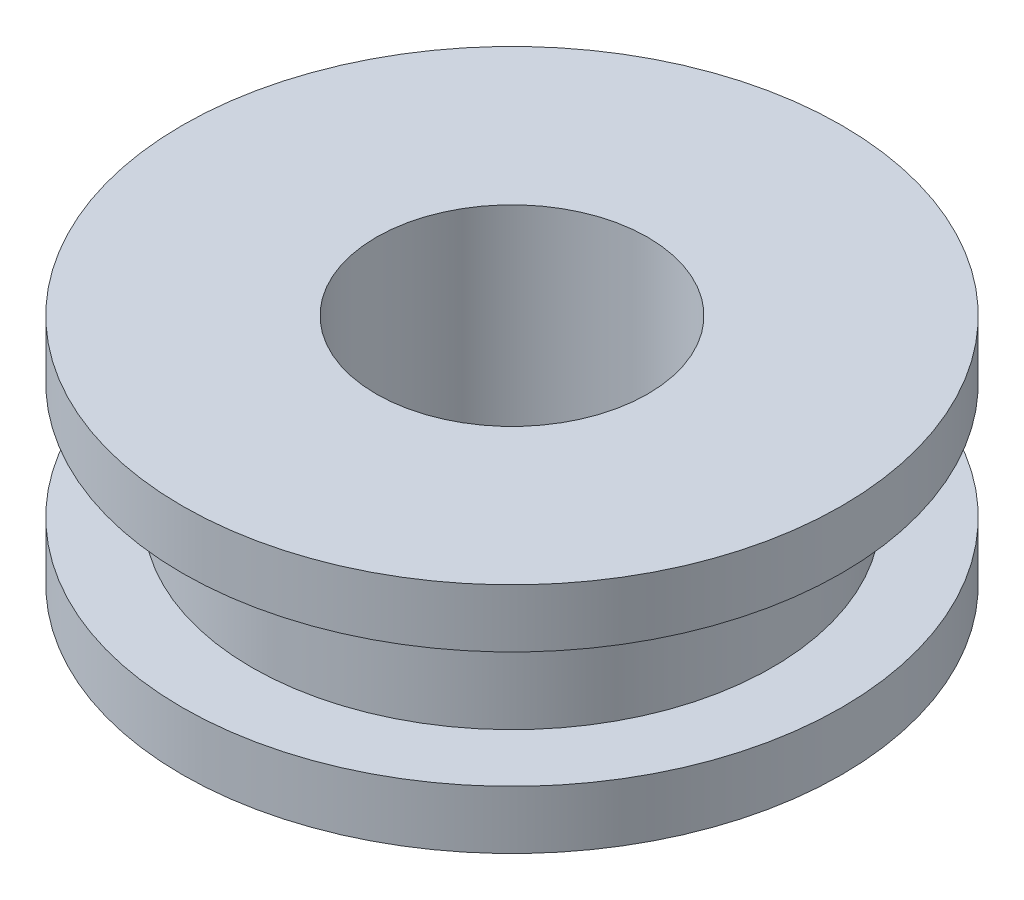
ISO-10303-21;
HEADER;
FILE_DESCRIPTION(('STEP AP214'),'2;1');
FILE_NAME('part.step','',(''),(''),'','','');
FILE_SCHEMA(('AUTOMOTIVE_DESIGN { 1 0 10303 214 1 1 1 1 }'));
ENDSEC;
DATA;
#1=APPLICATION_CONTEXT('core data for automotive mechanical design processes');
#2=APPLICATION_PROTOCOL_DEFINITION('international standard','automotive_design',2000,#1);
#3=PRODUCT_CONTEXT('',#1,'mechanical');
#4=PRODUCT('Part','Part','',(#3));
#5=PRODUCT_RELATED_PRODUCT_CATEGORY('part','',(#4));
#6=PRODUCT_DEFINITION_FORMATION('','',#4);
#7=PRODUCT_DEFINITION_CONTEXT('part definition',#1,'design');
#8=PRODUCT_DEFINITION('design','',#6,#7);
#9=PRODUCT_DEFINITION_SHAPE('','',#8);
#10=(LENGTH_UNIT() NAMED_UNIT(*) SI_UNIT(.MILLI.,.METRE.));
#11=(NAMED_UNIT(*) PLANE_ANGLE_UNIT() SI_UNIT($,.RADIAN.));
#12=(NAMED_UNIT(*) SI_UNIT($,.STERADIAN.) SOLID_ANGLE_UNIT());
#13=UNCERTAINTY_MEASURE_WITH_UNIT(LENGTH_MEASURE(1.E-05),#10,'distance_accuracy_value','');
#14=(GEOMETRIC_REPRESENTATION_CONTEXT(3) GLOBAL_UNCERTAINTY_ASSIGNED_CONTEXT((#13)) GLOBAL_UNIT_ASSIGNED_CONTEXT((#10,
#11,#12)) REPRESENTATION_CONTEXT('',''));
#15=CARTESIAN_POINT('',(0.,0.,0.));
#16=DIRECTION('',(0.,0.,1.));
#17=DIRECTION('',(1.,0.,0.));
#18=AXIS2_PLACEMENT_3D('',#15,#16,#17);
#19=CARTESIAN_POINT('',(0.,6.,0.));
#20=DIRECTION('',(0.,-1.,0.));
#21=DIRECTION('',(0.,0.,-1.));
#22=AXIS2_PLACEMENT_3D('',#19,#20,#21);
#23=CYLINDRICAL_SURFACE('',#22,8.5);
#24=CARTESIAN_POINT('',(0.,0.,0.));
#25=DIRECTION('',(0.,1.,0.));
#26=DIRECTION('',(0.,0.,1.));
#27=AXIS2_PLACEMENT_3D('',#24,#25,#26);
#28=CIRCLE('',#27,8.5);
#29=CARTESIAN_POINT('',(0.,0.,8.5));
#30=VERTEX_POINT('',#29);
#31=EDGE_CURVE('E45',#30,#30,#28,.T.);
#32=ORIENTED_EDGE('',*,*,#31,.T.);
#33=EDGE_LOOP('',(#32));
#34=FACE_BOUND('',#33,.T.);
#35=CARTESIAN_POINT('',(0.,1.5,0.));
#36=DIRECTION('',(0.,1.,0.));
#37=DIRECTION('',(0.,0.,1.));
#38=AXIS2_PLACEMENT_3D('',#35,#36,#37);
#39=CIRCLE('',#38,8.5);
#40=CARTESIAN_POINT('',(0.,1.5,8.5));
#41=VERTEX_POINT('',#40);
#42=EDGE_CURVE('E58',#41,#41,#39,.T.);
#43=ORIENTED_EDGE('',*,*,#42,.F.);
#44=EDGE_LOOP('',(#43));
#45=FACE_BOUND('',#44,.T.);
#46=ADVANCED_FACE('F36',(#34,#45),#23,.T.);
#47=CARTESIAN_POINT('',(0.,6.,0.));
#48=DIRECTION('',(0.,1.,0.));
#49=DIRECTION('',(0.,0.,1.));
#50=AXIS2_PLACEMENT_3D('',#47,#48,#49);
#51=PLANE('',#50);
#52=CARTESIAN_POINT('',(0.,6.,0.));
#53=DIRECTION('',(0.,1.,0.));
#54=DIRECTION('',(0.,0.,1.));
#55=AXIS2_PLACEMENT_3D('',#52,#53,#54);
#56=CIRCLE('',#55,8.5);
#57=CARTESIAN_POINT('',(0.,6.,8.5));
#58=VERTEX_POINT('',#57);
#59=EDGE_CURVE('E10',#58,#58,#56,.T.);
#60=ORIENTED_EDGE('',*,*,#59,.T.);
#61=EDGE_LOOP('',(#60));
#62=FACE_BOUND('',#61,.T.);
#63=CARTESIAN_POINT('',(0.,6.,0.));
#64=DIRECTION('',(0.,1.,0.));
#65=DIRECTION('',(0.,0.,1.));
#66=AXIS2_PLACEMENT_3D('',#63,#64,#65);
#67=CIRCLE('',#66,3.5);
#68=CARTESIAN_POINT('',(0.,6.,3.5));
#69=VERTEX_POINT('',#68);
#70=EDGE_CURVE('E53',#69,#69,#67,.T.);
#71=ORIENTED_EDGE('',*,*,#70,.F.);
#72=EDGE_LOOP('',(#71));
#73=FACE_BOUND('',#72,.T.);
#74=ADVANCED_FACE('F97',(#62,#73),#51,.T.);
#75=CARTESIAN_POINT('',(0.,0.,0.));
#76=DIRECTION('',(0.,1.,0.));
#77=DIRECTION('',(0.,0.,1.));
#78=AXIS2_PLACEMENT_3D('',#75,#76,#77);
#79=PLANE('',#78);
#80=ORIENTED_EDGE('',*,*,#31,.F.);
#81=EDGE_LOOP('',(#80));
#82=FACE_BOUND('',#81,.T.);
#83=CARTESIAN_POINT('',(0.,0.,0.));
#84=DIRECTION('',(0.,1.,0.));
#85=DIRECTION('',(0.,0.,1.));
#86=AXIS2_PLACEMENT_3D('',#83,#84,#85);
#87=CIRCLE('',#86,3.5);
#88=CARTESIAN_POINT('',(0.,0.,3.5));
#89=VERTEX_POINT('',#88);
#90=EDGE_CURVE('E56',#89,#89,#87,.T.);
#91=ORIENTED_EDGE('',*,*,#90,.T.);
#92=EDGE_LOOP('',(#91));
#93=FACE_BOUND('',#92,.T.);
#94=ADVANCED_FACE('F81',(#82,#93),#79,.F.);
#95=CARTESIAN_POINT('',(0.,4.5,0.));
#96=DIRECTION('',(0.,1.,0.));
#97=DIRECTION('',(0.,0.,1.));
#98=AXIS2_PLACEMENT_3D('',#95,#96,#97);
#99=CIRCLE('',#98,8.5);
#100=CARTESIAN_POINT('',(0.,4.5,8.5));
#101=VERTEX_POINT('',#100);
#102=EDGE_CURVE('E40',#101,#101,#99,.T.);
#103=ORIENTED_EDGE('',*,*,#102,.T.);
#104=EDGE_LOOP('',(#103));
#105=FACE_BOUND('',#104,.T.);
#106=ORIENTED_EDGE('',*,*,#59,.F.);
#107=EDGE_LOOP('',(#106));
#108=FACE_BOUND('',#107,.T.);
#109=ADVANCED_FACE('F38',(#105,#108),#23,.T.);
#110=CARTESIAN_POINT('',(0.,6.,0.));
#111=DIRECTION('',(0.,-1.,0.));
#112=DIRECTION('',(0.,0.,-1.));
#113=AXIS2_PLACEMENT_3D('',#110,#111,#112);
#114=CYLINDRICAL_SURFACE('',#113,3.5);
#115=ORIENTED_EDGE('',*,*,#70,.T.);
#116=EDGE_LOOP('',(#115));
#117=FACE_BOUND('',#116,.T.);
#118=ORIENTED_EDGE('',*,*,#90,.F.);
#119=EDGE_LOOP('',(#118));
#120=FACE_BOUND('',#119,.T.);
#121=ADVANCED_FACE('F83',(#117,#120),#114,.F.);
#122=CARTESIAN_POINT('',(0.,4.5,0.));
#123=DIRECTION('',(0.,1.,0.));
#124=DIRECTION('',(0.,0.,1.));
#125=AXIS2_PLACEMENT_3D('',#122,#123,#124);
#126=PLANE('',#125);
#127=CARTESIAN_POINT('',(0.,4.5,0.));
#128=DIRECTION('',(0.,1.,0.));
#129=DIRECTION('',(0.,0.,1.));
#130=AXIS2_PLACEMENT_3D('',#127,#128,#129);
#131=CIRCLE('',#130,6.70973029059589);
#132=CARTESIAN_POINT('',(0.,4.5,6.70973029059589));
#133=VERTEX_POINT('',#132);
#134=EDGE_CURVE('E60',#133,#133,#131,.T.);
#135=ORIENTED_EDGE('',*,*,#134,.T.);
#136=EDGE_LOOP('',(#135));
#137=FACE_BOUND('',#136,.T.);
#138=ORIENTED_EDGE('',*,*,#102,.F.);
#139=EDGE_LOOP('',(#138));
#140=FACE_BOUND('',#139,.T.);
#141=ADVANCED_FACE('F85',(#137,#140),#126,.F.);
#142=CARTESIAN_POINT('',(0.,1.5,0.));
#143=DIRECTION('',(0.,1.,0.));
#144=DIRECTION('',(0.,0.,1.));
#145=AXIS2_PLACEMENT_3D('',#142,#143,#144);
#146=PLANE('',#145);
#147=CARTESIAN_POINT('',(0.,1.5,0.));
#148=DIRECTION('',(0.,1.,0.));
#149=DIRECTION('',(0.,0.,1.));
#150=AXIS2_PLACEMENT_3D('',#147,#148,#149);
#151=CIRCLE('',#150,6.70973029059589);
#152=CARTESIAN_POINT('',(0.,1.5,6.70973029059589));
#153=VERTEX_POINT('',#152);
#154=EDGE_CURVE('E67',#153,#153,#151,.T.);
#155=ORIENTED_EDGE('',*,*,#154,.F.);
#156=EDGE_LOOP('',(#155));
#157=FACE_BOUND('',#156,.T.);
#158=ORIENTED_EDGE('',*,*,#42,.T.);
#159=EDGE_LOOP('',(#158));
#160=FACE_BOUND('',#159,.T.);
#161=ADVANCED_FACE('F91',(#157,#160),#146,.T.);
#162=CARTESIAN_POINT('',(0.,4.5,0.));
#163=DIRECTION('',(0.,-1.,0.));
#164=DIRECTION('',(0.,0.,-1.));
#165=AXIS2_PLACEMENT_3D('',#162,#163,#164);
#166=CYLINDRICAL_SURFACE('',#165,6.70973029059589);
#167=ORIENTED_EDGE('',*,*,#134,.F.);
#168=EDGE_LOOP('',(#167));
#169=FACE_BOUND('',#168,.T.);
#170=ORIENTED_EDGE('',*,*,#154,.T.);
#171=EDGE_LOOP('',(#170));
#172=FACE_BOUND('',#171,.T.);
#173=ADVANCED_FACE('F129',(#169,#172),#166,.T.);
#174=CLOSED_SHELL('',(#46,#74,#94,#109,#121,#141,#161,#173));
#175=MANIFOLD_SOLID_BREP('B2',#174);
#176=ADVANCED_BREP_SHAPE_REPRESENTATION('',(#18,#175),#14);
#177=SHAPE_DEFINITION_REPRESENTATION(#9,#176);
ENDSEC;
END-ISO-10303-21;
